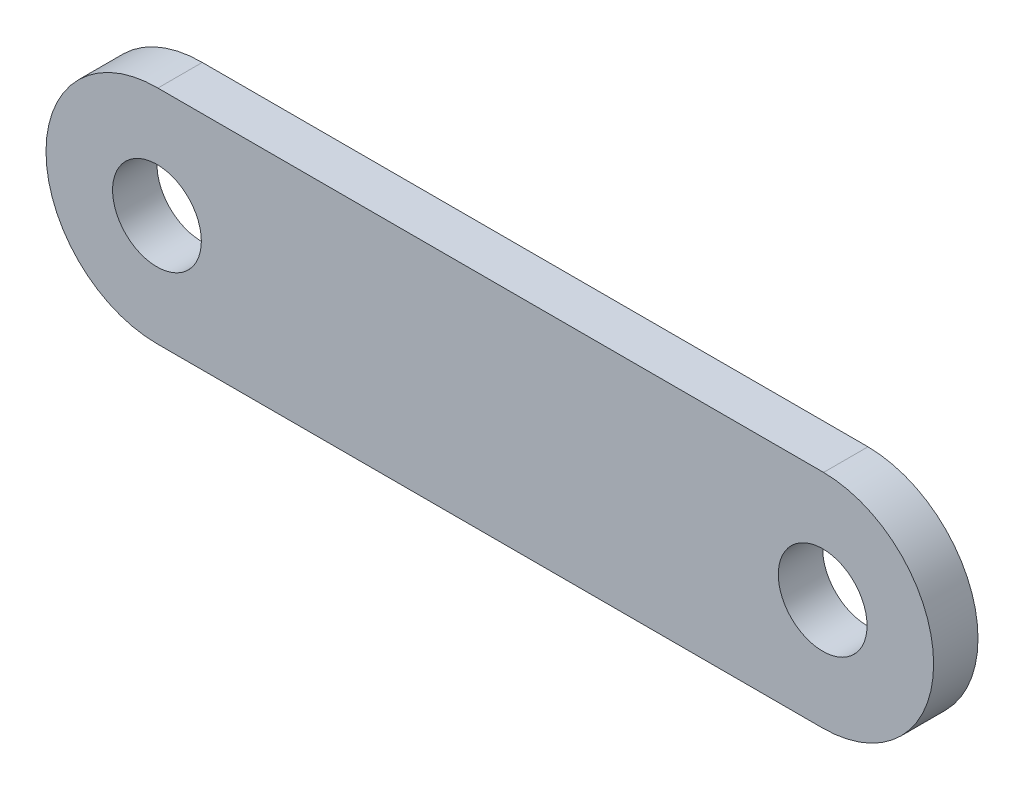
ISO-10303-21;
HEADER;
FILE_DESCRIPTION(('STEP AP214'),'2;1');
FILE_NAME('part.step','',(''),(''),'','','');
FILE_SCHEMA(('AUTOMOTIVE_DESIGN { 1 0 10303 214 1 1 1 1 }'));
ENDSEC;
DATA;
#1=APPLICATION_CONTEXT('core data for automotive mechanical design processes');
#2=APPLICATION_PROTOCOL_DEFINITION('international standard','automotive_design',2000,#1);
#3=PRODUCT_CONTEXT('',#1,'mechanical');
#4=PRODUCT('Part','Part','',(#3));
#5=PRODUCT_RELATED_PRODUCT_CATEGORY('part','',(#4));
#6=PRODUCT_DEFINITION_FORMATION('','',#4);
#7=PRODUCT_DEFINITION_CONTEXT('part definition',#1,'design');
#8=PRODUCT_DEFINITION('design','',#6,#7);
#9=PRODUCT_DEFINITION_SHAPE('','',#8);
#10=(LENGTH_UNIT() NAMED_UNIT(*) SI_UNIT(.MILLI.,.METRE.));
#11=(NAMED_UNIT(*) PLANE_ANGLE_UNIT() SI_UNIT($,.RADIAN.));
#12=(NAMED_UNIT(*) SI_UNIT($,.STERADIAN.) SOLID_ANGLE_UNIT());
#13=UNCERTAINTY_MEASURE_WITH_UNIT(LENGTH_MEASURE(1.E-05),#10,'distance_accuracy_value','');
#14=(GEOMETRIC_REPRESENTATION_CONTEXT(3) GLOBAL_UNCERTAINTY_ASSIGNED_CONTEXT((#13)) GLOBAL_UNIT_ASSIGNED_CONTEXT((#10,
#11,#12)) REPRESENTATION_CONTEXT('',''));
#15=CARTESIAN_POINT('',(0.,0.,0.));
#16=DIRECTION('',(0.,0.,1.));
#17=DIRECTION('',(1.,0.,0.));
#18=AXIS2_PLACEMENT_3D('',#15,#16,#17);
#19=CARTESIAN_POINT('',(0.,2.49991042182434,1.));
#20=DIRECTION('',(0.,1.,0.));
#21=DIRECTION('',(0.,0.,1.));
#22=AXIS2_PLACEMENT_3D('',#19,#20,#21);
#23=PLANE('',#22);
#24=DIRECTION('',(1.,0.,0.));
#25=VECTOR('',#24,1.);
#26=CARTESIAN_POINT('',(0.,2.49991042182434,0.));
#27=LINE('',#26,#25);
#28=CARTESIAN_POINT('',(-14.9788367570059,2.49991042182434,0.));
#29=VERTEX_POINT('',#28);
#30=CARTESIAN_POINT('',(0.0211632429941268,2.49991042182434,0.));
#31=VERTEX_POINT('',#30);
#32=EDGE_CURVE('E106',#29,#31,#27,.T.);
#33=ORIENTED_EDGE('',*,*,#32,.F.);
#34=DIRECTION('',(0.,0.,-1.));
#35=VECTOR('',#34,1.);
#36=CARTESIAN_POINT('',(-14.9788367570059,2.49991042182434,1.));
#37=LINE('',#36,#35);
#38=CARTESIAN_POINT('',(-14.9788367570059,2.49991042182434,1.));
#39=VERTEX_POINT('',#38);
#40=EDGE_CURVE('E11',#39,#29,#37,.T.);
#41=ORIENTED_EDGE('',*,*,#40,.F.);
#42=DIRECTION('',(1.,0.,0.));
#43=VECTOR('',#42,1.);
#44=CARTESIAN_POINT('',(0.,2.49991042182434,1.));
#45=LINE('',#44,#43);
#46=CARTESIAN_POINT('',(0.0211632429941268,2.49991042182434,1.));
#47=VERTEX_POINT('',#46);
#48=EDGE_CURVE('E92',#39,#47,#45,.T.);
#49=ORIENTED_EDGE('',*,*,#48,.T.);
#50=DIRECTION('',(0.,0.,-1.));
#51=VECTOR('',#50,1.);
#52=CARTESIAN_POINT('',(0.0211632429941268,2.49991042182434,1.));
#53=LINE('',#52,#51);
#54=EDGE_CURVE('E74',#47,#31,#53,.T.);
#55=ORIENTED_EDGE('',*,*,#54,.T.);
#56=EDGE_LOOP('',(#33,#41,#49,#55));
#57=FACE_BOUND('',#56,.T.);
#58=ADVANCED_FACE('F35',(#57),#23,.T.);
#59=CARTESIAN_POINT('',(-15.,0.,1.));
#60=DIRECTION('',(0.,0.,-1.));
#61=DIRECTION('',(-1.,0.,0.));
#62=AXIS2_PLACEMENT_3D('',#59,#60,#61);
#63=CYLINDRICAL_SURFACE('',#62,2.5);
#64=CARTESIAN_POINT('',(-15.,0.,0.));
#65=DIRECTION('',(0.,0.,1.));
#66=DIRECTION('',(1.,0.,0.));
#67=AXIS2_PLACEMENT_3D('',#64,#65,#66);
#68=CIRCLE('',#67,2.5);
#69=CARTESIAN_POINT('',(-15.,-2.5,0.));
#70=VERTEX_POINT('',#69);
#71=EDGE_CURVE('E97',#29,#70,#68,.T.);
#72=ORIENTED_EDGE('',*,*,#71,.T.);
#73=DIRECTION('',(0.,0.,-1.));
#74=VECTOR('',#73,1.);
#75=CARTESIAN_POINT('',(-15.,-2.5,1.));
#76=LINE('',#75,#74);
#77=CARTESIAN_POINT('',(-15.,-2.5,1.));
#78=VERTEX_POINT('',#77);
#79=EDGE_CURVE('E44',#78,#70,#76,.T.);
#80=ORIENTED_EDGE('',*,*,#79,.F.);
#81=CARTESIAN_POINT('',(-15.,0.,1.));
#82=DIRECTION('',(0.,0.,1.));
#83=DIRECTION('',(1.,0.,0.));
#84=AXIS2_PLACEMENT_3D('',#81,#82,#83);
#85=CIRCLE('',#84,2.5);
#86=EDGE_CURVE('E89',#39,#78,#85,.T.);
#87=ORIENTED_EDGE('',*,*,#86,.F.);
#88=ORIENTED_EDGE('',*,*,#40,.T.);
#89=EDGE_LOOP('',(#72,#80,#87,#88));
#90=FACE_BOUND('',#89,.T.);
#91=ADVANCED_FACE('F95',(#90),#63,.T.);
#92=CARTESIAN_POINT('',(0.,-2.5,1.));
#93=DIRECTION('',(0.,1.,0.));
#94=DIRECTION('',(0.,0.,1.));
#95=AXIS2_PLACEMENT_3D('',#92,#93,#94);
#96=PLANE('',#95);
#97=DIRECTION('',(1.,0.,0.));
#98=VECTOR('',#97,1.);
#99=CARTESIAN_POINT('',(0.,-2.5,0.));
#100=LINE('',#99,#98);
#101=CARTESIAN_POINT('',(0.,-2.5,0.));
#102=VERTEX_POINT('',#101);
#103=EDGE_CURVE('E103',#70,#102,#100,.T.);
#104=ORIENTED_EDGE('',*,*,#103,.T.);
#105=DIRECTION('',(0.,0.,-1.));
#106=VECTOR('',#105,1.);
#107=CARTESIAN_POINT('',(0.,-2.5,1.));
#108=LINE('',#107,#106);
#109=CARTESIAN_POINT('',(0.,-2.5,1.));
#110=VERTEX_POINT('',#109);
#111=EDGE_CURVE('E88',#110,#102,#108,.T.);
#112=ORIENTED_EDGE('',*,*,#111,.F.);
#113=DIRECTION('',(1.,0.,0.));
#114=VECTOR('',#113,1.);
#115=CARTESIAN_POINT('',(0.,-2.5,1.));
#116=LINE('',#115,#114);
#117=EDGE_CURVE('E82',#78,#110,#116,.T.);
#118=ORIENTED_EDGE('',*,*,#117,.F.);
#119=ORIENTED_EDGE('',*,*,#79,.T.);
#120=EDGE_LOOP('',(#104,#112,#118,#119));
#121=FACE_BOUND('',#120,.T.);
#122=ADVANCED_FACE('F85',(#121),#96,.F.);
#123=CARTESIAN_POINT('',(-15.,0.,1.));
#124=DIRECTION('',(0.,0.,-1.));
#125=DIRECTION('',(-1.,0.,0.));
#126=AXIS2_PLACEMENT_3D('',#123,#124,#125);
#127=CYLINDRICAL_SURFACE('',#126,1.);
#128=CARTESIAN_POINT('',(-15.,0.,1.));
#129=DIRECTION('',(0.,0.,1.));
#130=DIRECTION('',(1.,0.,0.));
#131=AXIS2_PLACEMENT_3D('',#128,#129,#130);
#132=CIRCLE('',#131,1.);
#133=CARTESIAN_POINT('',(-14.,0.,1.));
#134=VERTEX_POINT('',#133);
#135=EDGE_CURVE('E116',#134,#134,#132,.T.);
#136=ORIENTED_EDGE('',*,*,#135,.T.);
#137=EDGE_LOOP('',(#136));
#138=FACE_BOUND('',#137,.T.);
#139=CARTESIAN_POINT('',(-15.,0.,0.));
#140=DIRECTION('',(0.,0.,1.));
#141=DIRECTION('',(1.,0.,0.));
#142=AXIS2_PLACEMENT_3D('',#139,#140,#141);
#143=CIRCLE('',#142,1.);
#144=CARTESIAN_POINT('',(-14.,0.,0.));
#145=VERTEX_POINT('',#144);
#146=EDGE_CURVE('E108',#145,#145,#143,.T.);
#147=ORIENTED_EDGE('',*,*,#146,.F.);
#148=EDGE_LOOP('',(#147));
#149=FACE_BOUND('',#148,.T.);
#150=ADVANCED_FACE('F131',(#138,#149),#127,.F.);
#151=CARTESIAN_POINT('',(0.,0.,1.));
#152=DIRECTION('',(0.,0.,-1.));
#153=DIRECTION('',(-1.,0.,0.));
#154=AXIS2_PLACEMENT_3D('',#151,#152,#153);
#155=CYLINDRICAL_SURFACE('',#154,1.);
#156=CARTESIAN_POINT('',(0.,0.,1.));
#157=DIRECTION('',(0.,0.,1.));
#158=DIRECTION('',(1.,0.,0.));
#159=AXIS2_PLACEMENT_3D('',#156,#157,#158);
#160=CIRCLE('',#159,1.);
#161=CARTESIAN_POINT('',(1.,0.,1.));
#162=VERTEX_POINT('',#161);
#163=EDGE_CURVE('E102',#162,#162,#160,.T.);
#164=ORIENTED_EDGE('',*,*,#163,.T.);
#165=EDGE_LOOP('',(#164));
#166=FACE_BOUND('',#165,.T.);
#167=CARTESIAN_POINT('',(0.,0.,0.));
#168=DIRECTION('',(0.,0.,1.));
#169=DIRECTION('',(1.,0.,0.));
#170=AXIS2_PLACEMENT_3D('',#167,#168,#169);
#171=CIRCLE('',#170,1.);
#172=CARTESIAN_POINT('',(1.,0.,0.));
#173=VERTEX_POINT('',#172);
#174=EDGE_CURVE('E111',#173,#173,#171,.T.);
#175=ORIENTED_EDGE('',*,*,#174,.F.);
#176=EDGE_LOOP('',(#175));
#177=FACE_BOUND('',#176,.T.);
#178=ADVANCED_FACE('F37',(#166,#177),#155,.F.);
#179=CARTESIAN_POINT('',(0.,0.,1.));
#180=DIRECTION('',(0.,0.,-1.));
#181=DIRECTION('',(-1.,0.,0.));
#182=AXIS2_PLACEMENT_3D('',#179,#180,#181);
#183=CYLINDRICAL_SURFACE('',#182,2.5);
#184=CARTESIAN_POINT('',(0.,0.,0.));
#185=DIRECTION('',(0.,0.,1.));
#186=DIRECTION('',(1.,0.,0.));
#187=AXIS2_PLACEMENT_3D('',#184,#185,#186);
#188=CIRCLE('',#187,2.5);
#189=EDGE_CURVE('E67',#102,#31,#188,.T.);
#190=ORIENTED_EDGE('',*,*,#189,.T.);
#191=ORIENTED_EDGE('',*,*,#54,.F.);
#192=CARTESIAN_POINT('',(0.,0.,1.));
#193=DIRECTION('',(0.,0.,1.));
#194=DIRECTION('',(1.,0.,0.));
#195=AXIS2_PLACEMENT_3D('',#192,#193,#194);
#196=CIRCLE('',#195,2.5);
#197=EDGE_CURVE('E52',#110,#47,#196,.T.);
#198=ORIENTED_EDGE('',*,*,#197,.F.);
#199=ORIENTED_EDGE('',*,*,#111,.T.);
#200=EDGE_LOOP('',(#190,#191,#198,#199));
#201=FACE_BOUND('',#200,.T.);
#202=ADVANCED_FACE('F127',(#201),#183,.T.);
#203=CARTESIAN_POINT('',(0.,0.,1.));
#204=DIRECTION('',(0.,0.,1.));
#205=DIRECTION('',(1.,0.,0.));
#206=AXIS2_PLACEMENT_3D('',#203,#204,#205);
#207=PLANE('',#206);
#208=ORIENTED_EDGE('',*,*,#163,.F.);
#209=EDGE_LOOP('',(#208));
#210=FACE_BOUND('',#209,.T.);
#211=ORIENTED_EDGE('',*,*,#135,.F.);
#212=EDGE_LOOP('',(#211));
#213=FACE_BOUND('',#212,.T.);
#214=ORIENTED_EDGE('',*,*,#48,.F.);
#215=ORIENTED_EDGE('',*,*,#86,.T.);
#216=ORIENTED_EDGE('',*,*,#117,.T.);
#217=ORIENTED_EDGE('',*,*,#197,.T.);
#218=EDGE_LOOP('',(#214,#215,#216,#217));
#219=FACE_BOUND('',#218,.T.);
#220=ADVANCED_FACE('F91',(#210,#213,#219),#207,.T.);
#221=CARTESIAN_POINT('',(0.,0.,0.));
#222=DIRECTION('',(0.,0.,1.));
#223=DIRECTION('',(1.,0.,0.));
#224=AXIS2_PLACEMENT_3D('',#221,#222,#223);
#225=PLANE('',#224);
#226=ORIENTED_EDGE('',*,*,#174,.T.);
#227=EDGE_LOOP('',(#226));
#228=FACE_BOUND('',#227,.T.);
#229=ORIENTED_EDGE('',*,*,#146,.T.);
#230=EDGE_LOOP('',(#229));
#231=FACE_BOUND('',#230,.T.);
#232=ORIENTED_EDGE('',*,*,#32,.T.);
#233=ORIENTED_EDGE('',*,*,#189,.F.);
#234=ORIENTED_EDGE('',*,*,#103,.F.);
#235=ORIENTED_EDGE('',*,*,#71,.F.);
#236=EDGE_LOOP('',(#232,#233,#234,#235));
#237=FACE_BOUND('',#236,.T.);
#238=ADVANCED_FACE('F126',(#228,#231,#237),#225,.F.);
#239=CLOSED_SHELL('',(#58,#91,#122,#150,#178,#202,#220,#238));
#240=MANIFOLD_SOLID_BREP('B2',#239);
#241=ADVANCED_BREP_SHAPE_REPRESENTATION('',(#18,#240),#14);
#242=SHAPE_DEFINITION_REPRESENTATION(#9,#241);
ENDSEC;
END-ISO-10303-21;
